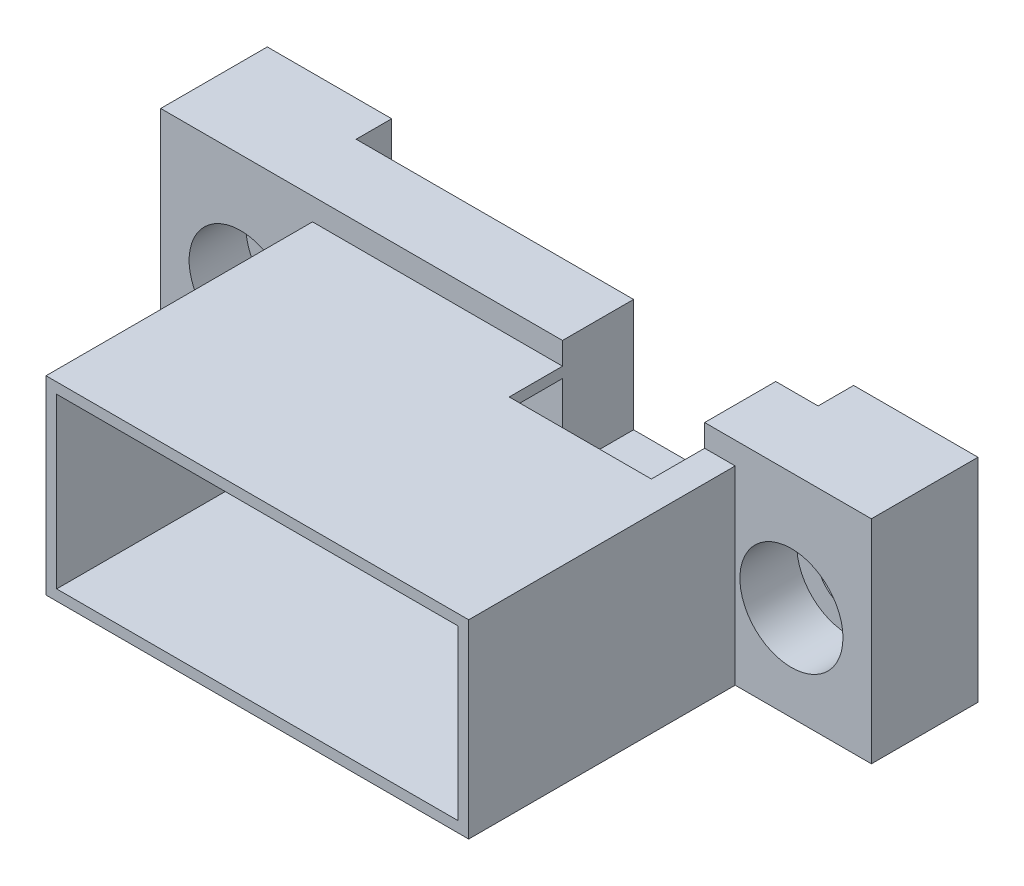
ISO-10303-21;
HEADER;
FILE_DESCRIPTION(('STEP AP214'),'2;1');
FILE_NAME('part.step','',(''),(''),'','','');
FILE_SCHEMA(('AUTOMOTIVE_DESIGN { 1 0 10303 214 1 1 1 1 }'));
ENDSEC;
DATA;
#1=APPLICATION_CONTEXT('core data for automotive mechanical design processes');
#2=APPLICATION_PROTOCOL_DEFINITION('international standard','automotive_design',2000,#1);
#3=PRODUCT_CONTEXT('',#1,'mechanical');
#4=PRODUCT('Part','Part','',(#3));
#5=PRODUCT_RELATED_PRODUCT_CATEGORY('part','',(#4));
#6=PRODUCT_DEFINITION_FORMATION('','',#4);
#7=PRODUCT_DEFINITION_CONTEXT('part definition',#1,'design');
#8=PRODUCT_DEFINITION('design','',#6,#7);
#9=PRODUCT_DEFINITION_SHAPE('','',#8);
#10=(LENGTH_UNIT() NAMED_UNIT(*) SI_UNIT(.MILLI.,.METRE.));
#11=(NAMED_UNIT(*) PLANE_ANGLE_UNIT() SI_UNIT($,.RADIAN.));
#12=(NAMED_UNIT(*) SI_UNIT($,.STERADIAN.) SOLID_ANGLE_UNIT());
#13=UNCERTAINTY_MEASURE_WITH_UNIT(LENGTH_MEASURE(1.E-05),#10,'distance_accuracy_value','');
#14=(GEOMETRIC_REPRESENTATION_CONTEXT(3) GLOBAL_UNCERTAINTY_ASSIGNED_CONTEXT((#13)) GLOBAL_UNIT_ASSIGNED_CONTEXT((#10,
#11,#12)) REPRESENTATION_CONTEXT('',''));
#15=CARTESIAN_POINT('',(0.,0.,0.));
#16=DIRECTION('',(0.,0.,1.));
#17=DIRECTION('',(1.,0.,0.));
#18=AXIS2_PLACEMENT_3D('',#15,#16,#17);
#19=CARTESIAN_POINT('',(0.,0.,7.62));
#20=DIRECTION('',(0.,0.,-1.));
#21=DIRECTION('',(-1.,0.,0.));
#22=AXIS2_PLACEMENT_3D('',#19,#20,#21);
#23=PLANE('',#22);
#24=CARTESIAN_POINT('',(-19.685,0.,7.62));
#25=DIRECTION('',(0.,0.,1.));
#26=DIRECTION('',(1.,0.,0.));
#27=AXIS2_PLACEMENT_3D('',#24,#25,#26);
#28=CIRCLE('',#27,3.683);
#29=CARTESIAN_POINT('',(-16.002,0.,7.62));
#30=VERTEX_POINT('',#29);
#31=EDGE_CURVE('E364',#30,#30,#28,.T.);
#32=ORIENTED_EDGE('',*,*,#31,.F.);
#33=EDGE_LOOP('',(#32));
#34=FACE_BOUND('',#33,.T.);
#35=DIRECTION('',(0.,-1.,0.));
#36=VECTOR('',#35,1.);
#37=CARTESIAN_POINT('',(-25.4,-8.382,7.62));
#38=LINE('',#37,#36);
#39=CARTESIAN_POINT('',(-25.4,8.382,7.62));
#40=VERTEX_POINT('',#39);
#41=CARTESIAN_POINT('',(-25.4,-6.78815,7.62));
#42=VERTEX_POINT('',#41);
#43=EDGE_CURVE('E229',#40,#42,#38,.T.);
#44=ORIENTED_EDGE('',*,*,#43,.T.);
#45=DIRECTION('',(1.,0.,0.));
#46=VECTOR('',#45,1.);
#47=CARTESIAN_POINT('',(0.,-6.78815,7.62));
#48=LINE('',#47,#46);
#49=CARTESIAN_POINT('',(-14.54785,-6.78815,7.62));
#50=VERTEX_POINT('',#49);
#51=EDGE_CURVE('E409',#42,#50,#48,.T.);
#52=ORIENTED_EDGE('',*,*,#51,.T.);
#53=DIRECTION('',(0.,-1.,0.));
#54=VECTOR('',#53,1.);
#55=CARTESIAN_POINT('',(-14.54785,6.78815,7.62));
#56=LINE('',#55,#54);
#57=CARTESIAN_POINT('',(-14.54785,6.78815,7.62));
#58=VERTEX_POINT('',#57);
#59=EDGE_CURVE('E302',#58,#50,#56,.T.);
#60=ORIENTED_EDGE('',*,*,#59,.F.);
#61=DIRECTION('',(-1.,0.,0.));
#62=VECTOR('',#61,1.);
#63=CARTESIAN_POINT('',(-14.54785,6.78815,7.62));
#64=LINE('',#63,#62);
#65=CARTESIAN_POINT('',(3.32105,6.78815,7.62));
#66=VERTEX_POINT('',#65);
#67=EDGE_CURVE('E287',#66,#58,#64,.T.);
#68=ORIENTED_EDGE('',*,*,#67,.F.);
#69=DIRECTION('',(0.,1.,0.));
#70=VECTOR('',#69,1.);
#71=CARTESIAN_POINT('',(3.32105,0.,7.62));
#72=LINE('',#71,#70);
#73=CARTESIAN_POINT('',(3.32105,8.382,7.62));
#74=VERTEX_POINT('',#73);
#75=EDGE_CURVE('E397',#66,#74,#72,.T.);
#76=ORIENTED_EDGE('',*,*,#75,.T.);
#77=DIRECTION('',(-1.,0.,0.));
#78=VECTOR('',#77,1.);
#79=CARTESIAN_POINT('',(-25.4,8.382,7.62));
#80=LINE('',#79,#78);
#81=EDGE_CURVE('E384',#74,#40,#80,.T.);
#82=ORIENTED_EDGE('',*,*,#81,.T.);
#83=EDGE_LOOP('',(#44,#52,#60,#68,#76,#82));
#84=FACE_BOUND('',#83,.T.);
#85=ADVANCED_FACE('F37',(#34,#84),#23,.F.);
#86=CARTESIAN_POINT('',(-25.4,8.382,7.62));
#87=DIRECTION('',(0.,-1.,0.));
#88=DIRECTION('',(0.,0.,-1.));
#89=AXIS2_PLACEMENT_3D('',#86,#87,#88);
#90=PLANE('',#89);
#91=DIRECTION('',(0.,0.,1.));
#92=VECTOR('',#91,1.);
#93=CARTESIAN_POINT('',(13.48105,8.382,2.54));
#94=LINE('',#93,#92);
#95=CARTESIAN_POINT('',(13.48105,8.382,2.54));
#96=VERTEX_POINT('',#95);
#97=CARTESIAN_POINT('',(13.48105,8.382,7.62));
#98=VERTEX_POINT('',#97);
#99=EDGE_CURVE('E320',#96,#98,#94,.T.);
#100=ORIENTED_EDGE('',*,*,#99,.T.);
#101=CARTESIAN_POINT('',(25.4,8.382,7.62));
#102=VERTEX_POINT('',#101);
#103=EDGE_CURVE('E385',#102,#98,#80,.T.);
#104=ORIENTED_EDGE('',*,*,#103,.F.);
#105=DIRECTION('',(0.,0.,-1.));
#106=VECTOR('',#105,1.);
#107=CARTESIAN_POINT('',(25.4,8.382,7.62));
#108=LINE('',#107,#106);
#109=CARTESIAN_POINT('',(25.4,8.382,0.));
#110=VERTEX_POINT('',#109);
#111=EDGE_CURVE('E238',#102,#110,#108,.T.);
#112=ORIENTED_EDGE('',*,*,#111,.T.);
#113=DIRECTION('',(-1.,0.,0.));
#114=VECTOR('',#113,1.);
#115=CARTESIAN_POINT('',(-25.4,8.382,0.));
#116=LINE('',#115,#114);
#117=CARTESIAN_POINT('',(16.51,8.382,0.));
#118=VERTEX_POINT('',#117);
#119=EDGE_CURVE('E219',#110,#118,#116,.T.);
#120=ORIENTED_EDGE('',*,*,#119,.T.);
#121=DIRECTION('',(0.,0.,1.));
#122=VECTOR('',#121,1.);
#123=CARTESIAN_POINT('',(16.51,8.382,7.62));
#124=LINE('',#123,#122);
#125=CARTESIAN_POINT('',(16.51,8.382,2.54));
#126=VERTEX_POINT('',#125);
#127=EDGE_CURVE('E342',#118,#126,#124,.T.);
#128=ORIENTED_EDGE('',*,*,#127,.T.);
#129=DIRECTION('',(-1.,0.,0.));
#130=VECTOR('',#129,1.);
#131=CARTESIAN_POINT('',(-25.4,8.382,2.54));
#132=LINE('',#131,#130);
#133=EDGE_CURVE('E334',#126,#96,#132,.T.);
#134=ORIENTED_EDGE('',*,*,#133,.T.);
#135=EDGE_LOOP('',(#100,#104,#112,#120,#128,#134));
#136=FACE_BOUND('',#135,.T.);
#137=ADVANCED_FACE('F499',(#136),#90,.F.);
#138=CARTESIAN_POINT('',(19.685,0.,7.62));
#139=DIRECTION('',(0.,0.,1.));
#140=DIRECTION('',(1.,0.,0.));
#141=AXIS2_PLACEMENT_3D('',#138,#139,#140);
#142=CIRCLE('',#141,3.683);
#143=CARTESIAN_POINT('',(23.368,0.,7.62));
#144=VERTEX_POINT('',#143);
#145=EDGE_CURVE('E367',#144,#144,#142,.T.);
#146=ORIENTED_EDGE('',*,*,#145,.F.);
#147=EDGE_LOOP('',(#146));
#148=FACE_BOUND('',#147,.T.);
#149=DIRECTION('',(0.,1.,0.));
#150=VECTOR('',#149,1.);
#151=CARTESIAN_POINT('',(15.66545,6.78815,7.62));
#152=LINE('',#151,#150);
#153=CARTESIAN_POINT('',(15.66545,-6.78815,7.62));
#154=VERTEX_POINT('',#153);
#155=CARTESIAN_POINT('',(15.66545,6.78815,7.62));
#156=VERTEX_POINT('',#155);
#157=EDGE_CURVE('E292',#154,#156,#152,.T.);
#158=ORIENTED_EDGE('',*,*,#157,.F.);
#159=CARTESIAN_POINT('',(25.4,-6.78815,7.62));
#160=VERTEX_POINT('',#159);
#161=EDGE_CURVE('E405',#154,#160,#48,.T.);
#162=ORIENTED_EDGE('',*,*,#161,.T.);
#163=DIRECTION('',(0.,1.,0.));
#164=VECTOR('',#163,1.);
#165=CARTESIAN_POINT('',(25.4,-8.382,7.62));
#166=LINE('',#165,#164);
#167=EDGE_CURVE('E213',#160,#102,#166,.T.);
#168=ORIENTED_EDGE('',*,*,#167,.T.);
#169=ORIENTED_EDGE('',*,*,#103,.T.);
#170=DIRECTION('',(0.,-1.,0.));
#171=VECTOR('',#170,1.);
#172=CARTESIAN_POINT('',(13.48105,0.,7.62));
#173=LINE('',#172,#171);
#174=CARTESIAN_POINT('',(13.48105,6.78815,7.62));
#175=VERTEX_POINT('',#174);
#176=EDGE_CURVE('E427',#98,#175,#173,.T.);
#177=ORIENTED_EDGE('',*,*,#176,.T.);
#178=EDGE_CURVE('E299',#156,#175,#64,.T.);
#179=ORIENTED_EDGE('',*,*,#178,.F.);
#180=EDGE_LOOP('',(#158,#162,#168,#169,#177,#179));
#181=FACE_BOUND('',#180,.T.);
#182=ADVANCED_FACE('F502',(#148,#181),#23,.F.);
#183=CARTESIAN_POINT('',(0.,0.,0.));
#184=DIRECTION('',(0.,0.,-1.));
#185=DIRECTION('',(-1.,0.,0.));
#186=AXIS2_PLACEMENT_3D('',#183,#184,#185);
#187=PLANE('',#186);
#188=DIRECTION('',(-1.,0.,0.));
#189=VECTOR('',#188,1.);
#190=CARTESIAN_POINT('',(-25.4,-6.78815,0.));
#191=LINE('',#190,#189);
#192=CARTESIAN_POINT('',(25.4,-6.78815,0.));
#193=VERTEX_POINT('',#192);
#194=CARTESIAN_POINT('',(16.51,-6.78815,0.));
#195=VERTEX_POINT('',#194);
#196=EDGE_CURVE('E195',#193,#195,#191,.T.);
#197=ORIENTED_EDGE('',*,*,#196,.T.);
#198=DIRECTION('',(0.,-1.,0.));
#199=VECTOR('',#198,1.);
#200=CARTESIAN_POINT('',(16.51,0.,0.));
#201=LINE('',#200,#199);
#202=EDGE_CURVE('E345',#118,#195,#201,.T.);
#203=ORIENTED_EDGE('',*,*,#202,.F.);
#204=ORIENTED_EDGE('',*,*,#119,.F.);
#205=DIRECTION('',(0.,1.,0.));
#206=VECTOR('',#205,1.);
#207=CARTESIAN_POINT('',(25.4,-8.382,0.));
#208=LINE('',#207,#206);
#209=EDGE_CURVE('E211',#193,#110,#208,.T.);
#210=ORIENTED_EDGE('',*,*,#209,.F.);
#211=EDGE_LOOP('',(#197,#203,#204,#210));
#212=FACE_BOUND('',#211,.T.);
#213=CARTESIAN_POINT('',(19.685,0.,0.));
#214=DIRECTION('',(0.,0.,1.));
#215=DIRECTION('',(1.,0.,0.));
#216=AXIS2_PLACEMENT_3D('',#213,#214,#215);
#217=CIRCLE('',#216,2.2225);
#218=CARTESIAN_POINT('',(21.9075,0.,0.));
#219=VERTEX_POINT('',#218);
#220=EDGE_CURVE('E347',#219,#219,#217,.T.);
#221=ORIENTED_EDGE('',*,*,#220,.T.);
#222=EDGE_LOOP('',(#221));
#223=FACE_BOUND('',#222,.T.);
#224=ADVANCED_FACE('F216',(#212,#223),#187,.T.);
#225=CARTESIAN_POINT('',(12.36345,-3.48615,7.62));
#226=DIRECTION('',(0.,0.,1.));
#227=DIRECTION('',(1.,0.,0.));
#228=AXIS2_PLACEMENT_3D('',#225,#226,#227);
#229=CIRCLE('',#228,0.825500000000003);
#230=CARTESIAN_POINT('',(13.18895,-3.48615,7.62));
#231=VERTEX_POINT('',#230);
#232=EDGE_CURVE('E222',#231,#231,#229,.T.);
#233=ORIENTED_EDGE('',*,*,#232,.F.);
#234=EDGE_LOOP('',(#233));
#235=FACE_BOUND('',#234,.T.);
#236=CARTESIAN_POINT('',(-11.24585,3.48615,7.62));
#237=DIRECTION('',(0.,0.,1.));
#238=DIRECTION('',(1.,0.,0.));
#239=AXIS2_PLACEMENT_3D('',#236,#237,#238);
#240=CIRCLE('',#239,0.825500000000009);
#241=CARTESIAN_POINT('',(-10.42035,3.48615,7.62));
#242=VERTEX_POINT('',#241);
#243=EDGE_CURVE('E363',#242,#242,#240,.T.);
#244=ORIENTED_EDGE('',*,*,#243,.F.);
#245=EDGE_LOOP('',(#244));
#246=FACE_BOUND('',#245,.T.);
#247=DIRECTION('',(-1.,0.,0.));
#248=VECTOR('',#247,1.);
#249=CARTESIAN_POINT('',(-13.78585,6.02615,7.62));
#250=LINE('',#249,#248);
#251=CARTESIAN_POINT('',(14.90345,6.02615,7.62));
#252=VERTEX_POINT('',#251);
#253=CARTESIAN_POINT('',(13.48105,6.02615,7.62));
#254=VERTEX_POINT('',#253);
#255=EDGE_CURVE('E268',#252,#254,#250,.T.);
#256=ORIENTED_EDGE('',*,*,#255,.T.);
#257=DIRECTION('',(0.,-1.,0.));
#258=VECTOR('',#257,1.);
#259=CARTESIAN_POINT('',(13.48105,0.,7.62));
#260=LINE('',#259,#258);
#261=CARTESIAN_POINT('',(13.48105,0.31115,7.62));
#262=VERTEX_POINT('',#261);
#263=EDGE_CURVE('E374',#254,#262,#260,.T.);
#264=ORIENTED_EDGE('',*,*,#263,.T.);
#265=DIRECTION('',(-1.,0.,0.));
#266=VECTOR('',#265,1.);
#267=CARTESIAN_POINT('',(0.,0.311149999999998,7.62));
#268=LINE('',#267,#266);
#269=CARTESIAN_POINT('',(3.32105,0.311149999999998,7.62));
#270=VERTEX_POINT('',#269);
#271=EDGE_CURVE('E379',#262,#270,#268,.T.);
#272=ORIENTED_EDGE('',*,*,#271,.T.);
#273=DIRECTION('',(0.,-1.,0.));
#274=VECTOR('',#273,1.);
#275=CARTESIAN_POINT('',(3.32105,0.,7.62));
#276=LINE('',#275,#274);
#277=CARTESIAN_POINT('',(3.32105,6.02615,7.62));
#278=VERTEX_POINT('',#277);
#279=EDGE_CURVE('E226',#278,#270,#276,.T.);
#280=ORIENTED_EDGE('',*,*,#279,.F.);
#281=CARTESIAN_POINT('',(-13.78585,6.02615,7.62));
#282=VERTEX_POINT('',#281);
#283=EDGE_CURVE('E260',#278,#282,#250,.T.);
#284=ORIENTED_EDGE('',*,*,#283,.T.);
#285=DIRECTION('',(0.,-1.,0.));
#286=VECTOR('',#285,1.);
#287=CARTESIAN_POINT('',(-13.78585,6.02615,7.62));
#288=LINE('',#287,#286);
#289=CARTESIAN_POINT('',(-13.78585,-6.02615,7.62));
#290=VERTEX_POINT('',#289);
#291=EDGE_CURVE('E429',#282,#290,#288,.T.);
#292=ORIENTED_EDGE('',*,*,#291,.T.);
#293=DIRECTION('',(1.,0.,0.));
#294=VECTOR('',#293,1.);
#295=CARTESIAN_POINT('',(-13.78585,-6.02615,7.62));
#296=LINE('',#295,#294);
#297=CARTESIAN_POINT('',(14.90345,-6.02615,7.62));
#298=VERTEX_POINT('',#297);
#299=EDGE_CURVE('E274',#290,#298,#296,.T.);
#300=ORIENTED_EDGE('',*,*,#299,.T.);
#301=DIRECTION('',(0.,1.,0.));
#302=VECTOR('',#301,1.);
#303=CARTESIAN_POINT('',(14.90345,6.02615,7.62));
#304=LINE('',#303,#302);
#305=EDGE_CURVE('E269',#298,#252,#304,.T.);
#306=ORIENTED_EDGE('',*,*,#305,.T.);
#307=EDGE_LOOP('',(#256,#264,#272,#280,#284,#292,#300,#306));
#308=FACE_BOUND('',#307,.T.);
#309=ADVANCED_FACE('F438',(#235,#246,#308),#23,.F.);
#310=CARTESIAN_POINT('',(-16.51,-6.78815,0.));
#311=VERTEX_POINT('',#310);
#312=CARTESIAN_POINT('',(-25.4,-6.78815,0.));
#313=VERTEX_POINT('',#312);
#314=EDGE_CURVE('E52',#311,#313,#191,.T.);
#315=ORIENTED_EDGE('',*,*,#314,.T.);
#316=DIRECTION('',(0.,-1.,0.));
#317=VECTOR('',#316,1.);
#318=CARTESIAN_POINT('',(-25.4,-8.382,0.));
#319=LINE('',#318,#317);
#320=CARTESIAN_POINT('',(-25.4,8.382,0.));
#321=VERTEX_POINT('',#320);
#322=EDGE_CURVE('E232',#321,#313,#319,.T.);
#323=ORIENTED_EDGE('',*,*,#322,.F.);
#324=CARTESIAN_POINT('',(-16.51,8.382,0.));
#325=VERTEX_POINT('',#324);
#326=EDGE_CURVE('E221',#325,#321,#116,.T.);
#327=ORIENTED_EDGE('',*,*,#326,.F.);
#328=DIRECTION('',(0.,1.,0.));
#329=VECTOR('',#328,1.);
#330=CARTESIAN_POINT('',(-16.51,0.,0.));
#331=LINE('',#330,#329);
#332=EDGE_CURVE('E340',#311,#325,#331,.T.);
#333=ORIENTED_EDGE('',*,*,#332,.F.);
#334=EDGE_LOOP('',(#315,#323,#327,#333));
#335=FACE_BOUND('',#334,.T.);
#336=CARTESIAN_POINT('',(-19.685,0.,0.));
#337=DIRECTION('',(0.,0.,1.));
#338=DIRECTION('',(1.,0.,0.));
#339=AXIS2_PLACEMENT_3D('',#336,#337,#338);
#340=CIRCLE('',#339,2.2225);
#341=CARTESIAN_POINT('',(-17.4625,0.,0.));
#342=VERTEX_POINT('',#341);
#343=EDGE_CURVE('E348',#342,#342,#340,.T.);
#344=ORIENTED_EDGE('',*,*,#343,.T.);
#345=EDGE_LOOP('',(#344));
#346=FACE_BOUND('',#345,.T.);
#347=ADVANCED_FACE('F476',(#335,#346),#187,.T.);
#348=CARTESIAN_POINT('',(25.4,-8.382,7.62));
#349=DIRECTION('',(-1.,0.,0.));
#350=DIRECTION('',(0.,0.,1.));
#351=AXIS2_PLACEMENT_3D('',#348,#349,#350);
#352=PLANE('',#351);
#353=ORIENTED_EDGE('',*,*,#167,.F.);
#354=DIRECTION('',(0.,0.,1.));
#355=VECTOR('',#354,1.);
#356=CARTESIAN_POINT('',(25.4,-6.78815,0.));
#357=LINE('',#356,#355);
#358=EDGE_CURVE('E199',#193,#160,#357,.T.);
#359=ORIENTED_EDGE('',*,*,#358,.F.);
#360=ORIENTED_EDGE('',*,*,#209,.T.);
#361=ORIENTED_EDGE('',*,*,#111,.F.);
#362=EDGE_LOOP('',(#353,#359,#360,#361));
#363=FACE_BOUND('',#362,.T.);
#364=ADVANCED_FACE('F39',(#363),#352,.F.);
#365=ORIENTED_EDGE('',*,*,#81,.F.);
#366=DIRECTION('',(0.,0.,-1.));
#367=VECTOR('',#366,1.);
#368=CARTESIAN_POINT('',(3.32105,8.382,2.54));
#369=LINE('',#368,#367);
#370=CARTESIAN_POINT('',(3.32105,8.382,2.54));
#371=VERTEX_POINT('',#370);
#372=EDGE_CURVE('E317',#74,#371,#369,.T.);
#373=ORIENTED_EDGE('',*,*,#372,.T.);
#374=CARTESIAN_POINT('',(-16.51,8.382,2.54));
#375=VERTEX_POINT('',#374);
#376=EDGE_CURVE('E333',#371,#375,#132,.T.);
#377=ORIENTED_EDGE('',*,*,#376,.T.);
#378=DIRECTION('',(0.,0.,-1.));
#379=VECTOR('',#378,1.);
#380=CARTESIAN_POINT('',(-16.51,8.382,7.62));
#381=LINE('',#380,#379);
#382=EDGE_CURVE('E337',#375,#325,#381,.T.);
#383=ORIENTED_EDGE('',*,*,#382,.T.);
#384=ORIENTED_EDGE('',*,*,#326,.T.);
#385=DIRECTION('',(0.,0.,-1.));
#386=VECTOR('',#385,1.);
#387=CARTESIAN_POINT('',(-25.4,8.382,7.62));
#388=LINE('',#387,#386);
#389=EDGE_CURVE('E235',#40,#321,#388,.T.);
#390=ORIENTED_EDGE('',*,*,#389,.F.);
#391=EDGE_LOOP('',(#365,#373,#377,#383,#384,#390));
#392=FACE_BOUND('',#391,.T.);
#393=ADVANCED_FACE('F399',(#392),#90,.F.);
#394=CARTESIAN_POINT('',(-25.4,-8.382,7.62));
#395=DIRECTION('',(1.,0.,0.));
#396=DIRECTION('',(0.,0.,-1.));
#397=AXIS2_PLACEMENT_3D('',#394,#395,#396);
#398=PLANE('',#397);
#399=ORIENTED_EDGE('',*,*,#322,.T.);
#400=DIRECTION('',(0.,0.,1.));
#401=VECTOR('',#400,1.);
#402=CARTESIAN_POINT('',(-25.4,-6.78815,0.));
#403=LINE('',#402,#401);
#404=EDGE_CURVE('E214',#313,#42,#403,.T.);
#405=ORIENTED_EDGE('',*,*,#404,.T.);
#406=ORIENTED_EDGE('',*,*,#43,.F.);
#407=ORIENTED_EDGE('',*,*,#389,.T.);
#408=EDGE_LOOP('',(#399,#405,#406,#407));
#409=FACE_BOUND('',#408,.T.);
#410=ADVANCED_FACE('F404',(#409),#398,.F.);
#411=CARTESIAN_POINT('',(-11.24585,3.48615,0.));
#412=DIRECTION('',(0.,0.,1.));
#413=DIRECTION('',(1.,0.,0.));
#414=AXIS2_PLACEMENT_3D('',#411,#412,#413);
#415=CYLINDRICAL_SURFACE('',#414,0.825500000000009);
#416=CARTESIAN_POINT('',(-11.24585,3.48615,2.54));
#417=DIRECTION('',(0.,0.,1.));
#418=DIRECTION('',(1.,0.,0.));
#419=AXIS2_PLACEMENT_3D('',#416,#417,#418);
#420=CIRCLE('',#419,0.825500000000009);
#421=CARTESIAN_POINT('',(-10.42035,3.48615,2.54));
#422=VERTEX_POINT('',#421);
#423=EDGE_CURVE('E330',#422,#422,#420,.F.);
#424=ORIENTED_EDGE('',*,*,#423,.T.);
#425=EDGE_LOOP('',(#424));
#426=FACE_BOUND('',#425,.T.);
#427=ORIENTED_EDGE('',*,*,#243,.T.);
#428=EDGE_LOOP('',(#427));
#429=FACE_BOUND('',#428,.T.);
#430=ADVANCED_FACE('F523',(#426,#429),#415,.F.);
#431=CARTESIAN_POINT('',(13.48105,0.,0.));
#432=DIRECTION('',(-1.,0.,0.));
#433=DIRECTION('',(0.,-1.,0.));
#434=AXIS2_PLACEMENT_3D('',#431,#432,#433);
#435=PLANE('',#434);
#436=ORIENTED_EDGE('',*,*,#263,.F.);
#437=DIRECTION('',(0.,0.,1.));
#438=VECTOR('',#437,1.);
#439=CARTESIAN_POINT('',(13.48105,6.02615,26.67));
#440=LINE('',#439,#438);
#441=CARTESIAN_POINT('',(13.48105,6.02615,11.43));
#442=VERTEX_POINT('',#441);
#443=EDGE_CURVE('E11',#254,#442,#440,.T.);
#444=ORIENTED_EDGE('',*,*,#443,.T.);
#445=DIRECTION('',(0.,-1.,0.));
#446=VECTOR('',#445,1.);
#447=CARTESIAN_POINT('',(13.48105,8.382,11.43));
#448=LINE('',#447,#446);
#449=CARTESIAN_POINT('',(13.48105,6.78815,11.43));
#450=VERTEX_POINT('',#449);
#451=EDGE_CURVE('E60',#450,#442,#448,.T.);
#452=ORIENTED_EDGE('',*,*,#451,.F.);
#453=DIRECTION('',(0.,0.,1.));
#454=VECTOR('',#453,1.);
#455=CARTESIAN_POINT('',(13.48105,6.78815,26.67));
#456=LINE('',#455,#454);
#457=EDGE_CURVE('E424',#175,#450,#456,.T.);
#458=ORIENTED_EDGE('',*,*,#457,.F.);
#459=ORIENTED_EDGE('',*,*,#176,.F.);
#460=ORIENTED_EDGE('',*,*,#99,.F.);
#461=DIRECTION('',(0.,1.,0.));
#462=VECTOR('',#461,1.);
#463=CARTESIAN_POINT('',(13.48105,0.,2.54));
#464=LINE('',#463,#462);
#465=CARTESIAN_POINT('',(13.48105,0.31115,2.54));
#466=VERTEX_POINT('',#465);
#467=EDGE_CURVE('E328',#466,#96,#464,.T.);
#468=ORIENTED_EDGE('',*,*,#467,.F.);
#469=DIRECTION('',(0.,0.,1.));
#470=VECTOR('',#469,1.);
#471=CARTESIAN_POINT('',(13.48105,0.31115,0.));
#472=LINE('',#471,#470);
#473=EDGE_CURVE('E375',#466,#262,#472,.T.);
#474=ORIENTED_EDGE('',*,*,#473,.T.);
#475=EDGE_LOOP('',(#436,#444,#452,#458,#459,#460,#468,#474));
#476=FACE_BOUND('',#475,.T.);
#477=ADVANCED_FACE('F457',(#476),#435,.T.);
#478=CARTESIAN_POINT('',(0.,0.311149999999998,0.));
#479=DIRECTION('',(0.,1.,0.));
#480=DIRECTION('',(-1.,0.,0.));
#481=AXIS2_PLACEMENT_3D('',#478,#479,#480);
#482=PLANE('',#481);
#483=DIRECTION('',(1.,0.,0.));
#484=VECTOR('',#483,1.);
#485=CARTESIAN_POINT('',(0.,0.311149999999998,2.54));
#486=LINE('',#485,#484);
#487=CARTESIAN_POINT('',(3.32105,0.311149999999998,2.54));
#488=VERTEX_POINT('',#487);
#489=EDGE_CURVE('E326',#488,#466,#486,.T.);
#490=ORIENTED_EDGE('',*,*,#489,.F.);
#491=DIRECTION('',(0.,0.,1.));
#492=VECTOR('',#491,1.);
#493=CARTESIAN_POINT('',(3.32105,0.311149999999998,0.));
#494=LINE('',#493,#492);
#495=EDGE_CURVE('E372',#488,#270,#494,.T.);
#496=ORIENTED_EDGE('',*,*,#495,.T.);
#497=ORIENTED_EDGE('',*,*,#271,.F.);
#498=ORIENTED_EDGE('',*,*,#473,.F.);
#499=EDGE_LOOP('',(#490,#496,#497,#498));
#500=FACE_BOUND('',#499,.T.);
#501=ADVANCED_FACE('F463',(#500),#482,.T.);
#502=CARTESIAN_POINT('',(3.32105,0.,0.));
#503=DIRECTION('',(-1.,0.,0.));
#504=DIRECTION('',(0.,-1.,0.));
#505=AXIS2_PLACEMENT_3D('',#502,#503,#504);
#506=PLANE('',#505);
#507=DIRECTION('',(0.,0.,-1.));
#508=VECTOR('',#507,1.);
#509=CARTESIAN_POINT('',(3.32105,6.02615,26.67));
#510=LINE('',#509,#508);
#511=CARTESIAN_POINT('',(3.32105,6.02615,11.43));
#512=VERTEX_POINT('',#511);
#513=EDGE_CURVE('E45',#512,#278,#510,.T.);
#514=ORIENTED_EDGE('',*,*,#513,.T.);
#515=ORIENTED_EDGE('',*,*,#279,.T.);
#516=ORIENTED_EDGE('',*,*,#495,.F.);
#517=DIRECTION('',(0.,1.,0.));
#518=VECTOR('',#517,1.);
#519=CARTESIAN_POINT('',(3.32105,0.,2.54));
#520=LINE('',#519,#518);
#521=EDGE_CURVE('E244',#488,#371,#520,.T.);
#522=ORIENTED_EDGE('',*,*,#521,.T.);
#523=ORIENTED_EDGE('',*,*,#372,.F.);
#524=ORIENTED_EDGE('',*,*,#75,.F.);
#525=DIRECTION('',(0.,0.,-1.));
#526=VECTOR('',#525,1.);
#527=CARTESIAN_POINT('',(3.32105,6.78815,26.67));
#528=LINE('',#527,#526);
#529=CARTESIAN_POINT('',(3.32105,6.78815,11.43));
#530=VERTEX_POINT('',#529);
#531=EDGE_CURVE('E420',#530,#66,#528,.T.);
#532=ORIENTED_EDGE('',*,*,#531,.F.);
#533=DIRECTION('',(0.,1.,0.));
#534=VECTOR('',#533,1.);
#535=CARTESIAN_POINT('',(3.32105,5.39115,11.43));
#536=LINE('',#535,#534);
#537=EDGE_CURVE('E257',#512,#530,#536,.T.);
#538=ORIENTED_EDGE('',*,*,#537,.F.);
#539=EDGE_LOOP('',(#514,#515,#516,#522,#523,#524,#532,#538));
#540=FACE_BOUND('',#539,.T.);
#541=ADVANCED_FACE('F253',(#540),#506,.F.);
#542=CARTESIAN_POINT('',(12.36345,-3.48615,0.));
#543=DIRECTION('',(0.,0.,1.));
#544=DIRECTION('',(1.,0.,0.));
#545=AXIS2_PLACEMENT_3D('',#542,#543,#544);
#546=CYLINDRICAL_SURFACE('',#545,0.825500000000003);
#547=CARTESIAN_POINT('',(12.36345,-3.48615,2.54));
#548=DIRECTION('',(0.,0.,1.));
#549=DIRECTION('',(1.,0.,0.));
#550=AXIS2_PLACEMENT_3D('',#547,#548,#549);
#551=CIRCLE('',#550,0.825500000000003);
#552=CARTESIAN_POINT('',(13.18895,-3.48615,2.54));
#553=VERTEX_POINT('',#552);
#554=EDGE_CURVE('E241',#553,#553,#551,.F.);
#555=ORIENTED_EDGE('',*,*,#554,.T.);
#556=EDGE_LOOP('',(#555));
#557=FACE_BOUND('',#556,.T.);
#558=ORIENTED_EDGE('',*,*,#232,.T.);
#559=EDGE_LOOP('',(#558));
#560=FACE_BOUND('',#559,.T.);
#561=ADVANCED_FACE('F538',(#557,#560),#546,.F.);
#562=CARTESIAN_POINT('',(19.685,0.,3.556));
#563=DIRECTION('',(0.,0.,1.));
#564=DIRECTION('',(1.,0.,0.));
#565=AXIS2_PLACEMENT_3D('',#562,#563,#564);
#566=CYLINDRICAL_SURFACE('',#565,3.683);
#567=CARTESIAN_POINT('',(19.685,0.,3.556));
#568=DIRECTION('',(0.,0.,1.));
#569=DIRECTION('',(1.,0.,0.));
#570=AXIS2_PLACEMENT_3D('',#567,#568,#569);
#571=CIRCLE('',#570,3.683);
#572=CARTESIAN_POINT('',(23.368,0.,3.556));
#573=VERTEX_POINT('',#572);
#574=EDGE_CURVE('E359',#573,#573,#571,.T.);
#575=ORIENTED_EDGE('',*,*,#574,.F.);
#576=EDGE_LOOP('',(#575));
#577=FACE_BOUND('',#576,.T.);
#578=ORIENTED_EDGE('',*,*,#145,.T.);
#579=EDGE_LOOP('',(#578));
#580=FACE_BOUND('',#579,.T.);
#581=ADVANCED_FACE('F541',(#577,#580),#566,.F.);
#582=CARTESIAN_POINT('',(19.685,0.,3.556));
#583=DIRECTION('',(0.,0.,1.));
#584=DIRECTION('',(1.,0.,0.));
#585=AXIS2_PLACEMENT_3D('',#582,#583,#584);
#586=PLANE('',#585);
#587=CARTESIAN_POINT('',(19.685,0.,3.556));
#588=DIRECTION('',(0.,0.,1.));
#589=DIRECTION('',(1.,0.,0.));
#590=AXIS2_PLACEMENT_3D('',#587,#588,#589);
#591=CIRCLE('',#590,2.2225);
#592=CARTESIAN_POINT('',(21.9075,0.,3.556));
#593=VERTEX_POINT('',#592);
#594=EDGE_CURVE('E356',#593,#593,#591,.T.);
#595=ORIENTED_EDGE('',*,*,#594,.F.);
#596=EDGE_LOOP('',(#595));
#597=FACE_BOUND('',#596,.T.);
#598=ORIENTED_EDGE('',*,*,#574,.T.);
#599=EDGE_LOOP('',(#598));
#600=FACE_BOUND('',#599,.T.);
#601=ADVANCED_FACE('F543',(#597,#600),#586,.T.);
#602=CARTESIAN_POINT('',(-19.685,0.,3.556));
#603=DIRECTION('',(0.,0.,1.));
#604=DIRECTION('',(1.,0.,0.));
#605=AXIS2_PLACEMENT_3D('',#602,#603,#604);
#606=CYLINDRICAL_SURFACE('',#605,3.683);
#607=CARTESIAN_POINT('',(-19.685,0.,3.556));
#608=DIRECTION('',(0.,0.,1.));
#609=DIRECTION('',(1.,0.,0.));
#610=AXIS2_PLACEMENT_3D('',#607,#608,#609);
#611=CIRCLE('',#610,3.683);
#612=CARTESIAN_POINT('',(-16.002,0.,3.556));
#613=VERTEX_POINT('',#612);
#614=EDGE_CURVE('E360',#613,#613,#611,.T.);
#615=ORIENTED_EDGE('',*,*,#614,.F.);
#616=EDGE_LOOP('',(#615));
#617=FACE_BOUND('',#616,.T.);
#618=ORIENTED_EDGE('',*,*,#31,.T.);
#619=EDGE_LOOP('',(#618));
#620=FACE_BOUND('',#619,.T.);
#621=ADVANCED_FACE('F494',(#617,#620),#606,.F.);
#622=CARTESIAN_POINT('',(-19.685,0.,3.556));
#623=DIRECTION('',(0.,0.,1.));
#624=DIRECTION('',(1.,0.,0.));
#625=AXIS2_PLACEMENT_3D('',#622,#623,#624);
#626=PLANE('',#625);
#627=CARTESIAN_POINT('',(-19.685,0.,3.556));
#628=DIRECTION('',(0.,0.,1.));
#629=DIRECTION('',(1.,0.,0.));
#630=AXIS2_PLACEMENT_3D('',#627,#628,#629);
#631=CIRCLE('',#630,2.2225);
#632=CARTESIAN_POINT('',(-17.4625,0.,3.556));
#633=VERTEX_POINT('',#632);
#634=EDGE_CURVE('E351',#633,#633,#631,.T.);
#635=ORIENTED_EDGE('',*,*,#634,.F.);
#636=EDGE_LOOP('',(#635));
#637=FACE_BOUND('',#636,.T.);
#638=ORIENTED_EDGE('',*,*,#614,.T.);
#639=EDGE_LOOP('',(#638));
#640=FACE_BOUND('',#639,.T.);
#641=ADVANCED_FACE('F485',(#637,#640),#626,.T.);
#642=CARTESIAN_POINT('',(-19.685,0.,0.));
#643=DIRECTION('',(0.,0.,1.));
#644=DIRECTION('',(1.,0.,0.));
#645=AXIS2_PLACEMENT_3D('',#642,#643,#644);
#646=CYLINDRICAL_SURFACE('',#645,2.2225);
#647=ORIENTED_EDGE('',*,*,#634,.T.);
#648=EDGE_LOOP('',(#647));
#649=FACE_BOUND('',#648,.T.);
#650=ORIENTED_EDGE('',*,*,#343,.F.);
#651=EDGE_LOOP('',(#650));
#652=FACE_BOUND('',#651,.T.);
#653=ADVANCED_FACE('F482',(#649,#652),#646,.F.);
#654=CARTESIAN_POINT('',(19.685,0.,0.));
#655=DIRECTION('',(0.,0.,1.));
#656=DIRECTION('',(1.,0.,0.));
#657=AXIS2_PLACEMENT_3D('',#654,#655,#656);
#658=CYLINDRICAL_SURFACE('',#657,2.2225);
#659=ORIENTED_EDGE('',*,*,#594,.T.);
#660=EDGE_LOOP('',(#659));
#661=FACE_BOUND('',#660,.T.);
#662=ORIENTED_EDGE('',*,*,#220,.F.);
#663=EDGE_LOOP('',(#662));
#664=FACE_BOUND('',#663,.T.);
#665=ADVANCED_FACE('F484',(#661,#664),#658,.F.);
#666=CARTESIAN_POINT('',(-16.51,-8.382,2.54));
#667=DIRECTION('',(0.,0.,1.));
#668=DIRECTION('',(1.,0.,0.));
#669=AXIS2_PLACEMENT_3D('',#666,#667,#668);
#670=PLANE('',#669);
#671=ORIENTED_EDGE('',*,*,#554,.F.);
#672=EDGE_LOOP('',(#671));
#673=FACE_BOUND('',#672,.T.);
#674=DIRECTION('',(0.,1.,0.));
#675=VECTOR('',#674,1.);
#676=CARTESIAN_POINT('',(16.51,-8.382,2.54));
#677=LINE('',#676,#675);
#678=CARTESIAN_POINT('',(16.51,-6.78815,2.54));
#679=VERTEX_POINT('',#678);
#680=EDGE_CURVE('E245',#679,#126,#677,.T.);
#681=ORIENTED_EDGE('',*,*,#680,.F.);
#682=DIRECTION('',(-1.,0.,0.));
#683=VECTOR('',#682,1.);
#684=CARTESIAN_POINT('',(-16.51,-6.78815,2.54));
#685=LINE('',#684,#683);
#686=CARTESIAN_POINT('',(-16.51,-6.78815,2.54));
#687=VERTEX_POINT('',#686);
#688=EDGE_CURVE('E412',#679,#687,#685,.T.);
#689=ORIENTED_EDGE('',*,*,#688,.T.);
#690=DIRECTION('',(0.,1.,0.));
#691=VECTOR('',#690,1.);
#692=CARTESIAN_POINT('',(-16.51,-8.382,2.54));
#693=LINE('',#692,#691);
#694=EDGE_CURVE('E322',#687,#375,#693,.T.);
#695=ORIENTED_EDGE('',*,*,#694,.T.);
#696=ORIENTED_EDGE('',*,*,#376,.F.);
#697=ORIENTED_EDGE('',*,*,#521,.F.);
#698=ORIENTED_EDGE('',*,*,#489,.T.);
#699=ORIENTED_EDGE('',*,*,#467,.T.);
#700=ORIENTED_EDGE('',*,*,#133,.F.);
#701=EDGE_LOOP('',(#681,#689,#695,#696,#697,#698,#699,#700));
#702=FACE_BOUND('',#701,.T.);
#703=ORIENTED_EDGE('',*,*,#423,.F.);
#704=EDGE_LOOP('',(#703));
#705=FACE_BOUND('',#704,.T.);
#706=ADVANCED_FACE('F469',(#673,#702,#705),#670,.F.);
#707=CARTESIAN_POINT('',(16.51,-8.382,-2.54));
#708=DIRECTION('',(1.,0.,0.));
#709=DIRECTION('',(0.,0.,-1.));
#710=AXIS2_PLACEMENT_3D('',#707,#708,#709);
#711=PLANE('',#710);
#712=ORIENTED_EDGE('',*,*,#202,.T.);
#713=DIRECTION('',(0.,0.,1.));
#714=VECTOR('',#713,1.);
#715=CARTESIAN_POINT('',(16.51,-6.78815,-2.54));
#716=LINE('',#715,#714);
#717=EDGE_CURVE('E202',#195,#679,#716,.T.);
#718=ORIENTED_EDGE('',*,*,#717,.T.);
#719=ORIENTED_EDGE('',*,*,#680,.T.);
#720=ORIENTED_EDGE('',*,*,#127,.F.);
#721=EDGE_LOOP('',(#712,#718,#719,#720));
#722=FACE_BOUND('',#721,.T.);
#723=ADVANCED_FACE('F767',(#722),#711,.F.);
#724=CARTESIAN_POINT('',(-16.51,-8.382,-2.54));
#725=DIRECTION('',(-1.,0.,0.));
#726=DIRECTION('',(0.,0.,1.));
#727=AXIS2_PLACEMENT_3D('',#724,#725,#726);
#728=PLANE('',#727);
#729=ORIENTED_EDGE('',*,*,#694,.F.);
#730=DIRECTION('',(0.,0.,-1.));
#731=VECTOR('',#730,1.);
#732=CARTESIAN_POINT('',(-16.51,-6.78815,-2.54));
#733=LINE('',#732,#731);
#734=EDGE_CURVE('E407',#687,#311,#733,.T.);
#735=ORIENTED_EDGE('',*,*,#734,.T.);
#736=ORIENTED_EDGE('',*,*,#332,.T.);
#737=ORIENTED_EDGE('',*,*,#382,.F.);
#738=EDGE_LOOP('',(#729,#735,#736,#737));
#739=FACE_BOUND('',#738,.T.);
#740=ADVANCED_FACE('F473',(#739),#728,.F.);
#741=CARTESIAN_POINT('',(0.,0.,26.67));
#742=DIRECTION('',(0.,0.,-1.));
#743=DIRECTION('',(-1.,0.,0.));
#744=AXIS2_PLACEMENT_3D('',#741,#742,#743);
#745=PLANE('',#744);
#746=DIRECTION('',(-1.,0.,0.));
#747=VECTOR('',#746,1.);
#748=CARTESIAN_POINT('',(-14.54785,6.78815,26.67));
#749=LINE('',#748,#747);
#750=CARTESIAN_POINT('',(15.66545,6.78815,26.67));
#751=VERTEX_POINT('',#750);
#752=CARTESIAN_POINT('',(-14.54785,6.78815,26.67));
#753=VERTEX_POINT('',#752);
#754=EDGE_CURVE('E288',#751,#753,#749,.T.);
#755=ORIENTED_EDGE('',*,*,#754,.T.);
#756=DIRECTION('',(0.,-1.,0.));
#757=VECTOR('',#756,1.);
#758=CARTESIAN_POINT('',(-14.54785,6.78815,26.67));
#759=LINE('',#758,#757);
#760=CARTESIAN_POINT('',(-14.54785,-6.78815,26.67));
#761=VERTEX_POINT('',#760);
#762=EDGE_CURVE('E291',#753,#761,#759,.T.);
#763=ORIENTED_EDGE('',*,*,#762,.T.);
#764=DIRECTION('',(1.,0.,0.));
#765=VECTOR('',#764,1.);
#766=CARTESIAN_POINT('',(-14.54785,-6.78815,26.67));
#767=LINE('',#766,#765);
#768=CARTESIAN_POINT('',(15.66545,-6.78815,26.67));
#769=VERTEX_POINT('',#768);
#770=EDGE_CURVE('E294',#761,#769,#767,.T.);
#771=ORIENTED_EDGE('',*,*,#770,.T.);
#772=DIRECTION('',(0.,1.,0.));
#773=VECTOR('',#772,1.);
#774=CARTESIAN_POINT('',(15.66545,6.78815,26.67));
#775=LINE('',#774,#773);
#776=EDGE_CURVE('E296',#769,#751,#775,.T.);
#777=ORIENTED_EDGE('',*,*,#776,.T.);
#778=EDGE_LOOP('',(#755,#763,#771,#777));
#779=FACE_BOUND('',#778,.T.);
#780=DIRECTION('',(0.,-1.,0.));
#781=VECTOR('',#780,1.);
#782=CARTESIAN_POINT('',(-13.78585,6.02615,26.67));
#783=LINE('',#782,#781);
#784=CARTESIAN_POINT('',(-13.78585,6.02615,26.67));
#785=VERTEX_POINT('',#784);
#786=CARTESIAN_POINT('',(-13.78585,-6.02615,26.67));
#787=VERTEX_POINT('',#786);
#788=EDGE_CURVE('E272',#785,#787,#783,.T.);
#789=ORIENTED_EDGE('',*,*,#788,.F.);
#790=DIRECTION('',(-1.,0.,0.));
#791=VECTOR('',#790,1.);
#792=CARTESIAN_POINT('',(-13.78585,6.02615,26.67));
#793=LINE('',#792,#791);
#794=CARTESIAN_POINT('',(14.90345,6.02615,26.67));
#795=VERTEX_POINT('',#794);
#796=EDGE_CURVE('E280',#795,#785,#793,.T.);
#797=ORIENTED_EDGE('',*,*,#796,.F.);
#798=DIRECTION('',(0.,1.,0.));
#799=VECTOR('',#798,1.);
#800=CARTESIAN_POINT('',(14.90345,6.02615,26.67));
#801=LINE('',#800,#799);
#802=CARTESIAN_POINT('',(14.90345,-6.02615,26.67));
#803=VERTEX_POINT('',#802);
#804=EDGE_CURVE('E433',#803,#795,#801,.T.);
#805=ORIENTED_EDGE('',*,*,#804,.F.);
#806=DIRECTION('',(1.,0.,0.));
#807=VECTOR('',#806,1.);
#808=CARTESIAN_POINT('',(-13.78585,-6.02615,26.67));
#809=LINE('',#808,#807);
#810=EDGE_CURVE('E431',#787,#803,#809,.T.);
#811=ORIENTED_EDGE('',*,*,#810,.F.);
#812=EDGE_LOOP('',(#789,#797,#805,#811));
#813=FACE_BOUND('',#812,.T.);
#814=ADVANCED_FACE('F450',(#779,#813),#745,.F.);
#815=CARTESIAN_POINT('',(-14.54785,6.78815,26.67));
#816=DIRECTION('',(0.,-1.,0.));
#817=DIRECTION('',(0.,0.,-1.));
#818=AXIS2_PLACEMENT_3D('',#815,#816,#817);
#819=PLANE('',#818);
#820=ORIENTED_EDGE('',*,*,#178,.T.);
#821=ORIENTED_EDGE('',*,*,#457,.T.);
#822=DIRECTION('',(1.,0.,0.));
#823=VECTOR('',#822,1.);
#824=CARTESIAN_POINT('',(-14.54785,6.78815,11.43));
#825=LINE('',#824,#823);
#826=EDGE_CURVE('E418',#530,#450,#825,.T.);
#827=ORIENTED_EDGE('',*,*,#826,.F.);
#828=ORIENTED_EDGE('',*,*,#531,.T.);
#829=ORIENTED_EDGE('',*,*,#67,.T.);
#830=DIRECTION('',(0.,0.,-1.));
#831=VECTOR('',#830,1.);
#832=CARTESIAN_POINT('',(-14.54785,6.78815,26.67));
#833=LINE('',#832,#831);
#834=EDGE_CURVE('E314',#753,#58,#833,.T.);
#835=ORIENTED_EDGE('',*,*,#834,.F.);
#836=ORIENTED_EDGE('',*,*,#754,.F.);
#837=DIRECTION('',(0.,0.,-1.));
#838=VECTOR('',#837,1.);
#839=CARTESIAN_POINT('',(15.66545,6.78815,26.67));
#840=LINE('',#839,#838);
#841=EDGE_CURVE('E298',#751,#156,#840,.T.);
#842=ORIENTED_EDGE('',*,*,#841,.T.);
#843=EDGE_LOOP('',(#820,#821,#827,#828,#829,#835,#836,#842));
#844=FACE_BOUND('',#843,.T.);
#845=ADVANCED_FACE('F611',(#844),#819,.F.);
#846=CARTESIAN_POINT('',(-14.54785,6.78815,26.67));
#847=DIRECTION('',(1.,0.,0.));
#848=DIRECTION('',(0.,0.,-1.));
#849=AXIS2_PLACEMENT_3D('',#846,#847,#848);
#850=PLANE('',#849);
#851=ORIENTED_EDGE('',*,*,#59,.T.);
#852=DIRECTION('',(0.,0.,-1.));
#853=VECTOR('',#852,1.);
#854=CARTESIAN_POINT('',(-14.54785,-6.78815,26.67));
#855=LINE('',#854,#853);
#856=EDGE_CURVE('E312',#761,#50,#855,.T.);
#857=ORIENTED_EDGE('',*,*,#856,.F.);
#858=ORIENTED_EDGE('',*,*,#762,.F.);
#859=ORIENTED_EDGE('',*,*,#834,.T.);
#860=EDGE_LOOP('',(#851,#857,#858,#859));
#861=FACE_BOUND('',#860,.T.);
#862=ADVANCED_FACE('F695',(#861),#850,.F.);
#863=CARTESIAN_POINT('',(-14.54785,-6.78815,26.67));
#864=DIRECTION('',(0.,1.,0.));
#865=DIRECTION('',(0.,0.,1.));
#866=AXIS2_PLACEMENT_3D('',#863,#864,#865);
#867=PLANE('',#866);
#868=ORIENTED_EDGE('',*,*,#856,.T.);
#869=ORIENTED_EDGE('',*,*,#51,.F.);
#870=ORIENTED_EDGE('',*,*,#404,.F.);
#871=ORIENTED_EDGE('',*,*,#314,.F.);
#872=ORIENTED_EDGE('',*,*,#734,.F.);
#873=ORIENTED_EDGE('',*,*,#688,.F.);
#874=ORIENTED_EDGE('',*,*,#717,.F.);
#875=ORIENTED_EDGE('',*,*,#196,.F.);
#876=ORIENTED_EDGE('',*,*,#358,.T.);
#877=ORIENTED_EDGE('',*,*,#161,.F.);
#878=DIRECTION('',(0.,0.,-1.));
#879=VECTOR('',#878,1.);
#880=CARTESIAN_POINT('',(15.66545,-6.78815,26.67));
#881=LINE('',#880,#879);
#882=EDGE_CURVE('E309',#769,#154,#881,.T.);
#883=ORIENTED_EDGE('',*,*,#882,.F.);
#884=ORIENTED_EDGE('',*,*,#770,.F.);
#885=EDGE_LOOP('',(#868,#869,#870,#871,#872,#873,#874,#875,#876,#877,#883,#884));
#886=FACE_BOUND('',#885,.T.);
#887=ADVANCED_FACE('F198',(#886),#867,.F.);
#888=CARTESIAN_POINT('',(15.66545,6.78815,26.67));
#889=DIRECTION('',(-1.,0.,0.));
#890=DIRECTION('',(0.,0.,1.));
#891=AXIS2_PLACEMENT_3D('',#888,#889,#890);
#892=PLANE('',#891);
#893=ORIENTED_EDGE('',*,*,#157,.T.);
#894=ORIENTED_EDGE('',*,*,#841,.F.);
#895=ORIENTED_EDGE('',*,*,#776,.F.);
#896=ORIENTED_EDGE('',*,*,#882,.T.);
#897=EDGE_LOOP('',(#893,#894,#895,#896));
#898=FACE_BOUND('',#897,.T.);
#899=ADVANCED_FACE('F626',(#898),#892,.F.);
#900=CARTESIAN_POINT('',(-13.78585,6.02615,26.67));
#901=DIRECTION('',(1.,0.,0.));
#902=DIRECTION('',(0.,0.,-1.));
#903=AXIS2_PLACEMENT_3D('',#900,#901,#902);
#904=PLANE('',#903);
#905=ORIENTED_EDGE('',*,*,#291,.F.);
#906=DIRECTION('',(0.,0.,-1.));
#907=VECTOR('',#906,1.);
#908=CARTESIAN_POINT('',(-13.78585,6.02615,26.67));
#909=LINE('',#908,#907);
#910=EDGE_CURVE('E264',#785,#282,#909,.T.);
#911=ORIENTED_EDGE('',*,*,#910,.F.);
#912=ORIENTED_EDGE('',*,*,#788,.T.);
#913=DIRECTION('',(0.,0.,-1.));
#914=VECTOR('',#913,1.);
#915=CARTESIAN_POINT('',(-13.78585,-6.02615,26.67));
#916=LINE('',#915,#914);
#917=EDGE_CURVE('E284',#787,#290,#916,.T.);
#918=ORIENTED_EDGE('',*,*,#917,.T.);
#919=EDGE_LOOP('',(#905,#911,#912,#918));
#920=FACE_BOUND('',#919,.T.);
#921=ADVANCED_FACE('F446',(#920),#904,.T.);
#922=CARTESIAN_POINT('',(-13.78585,-6.02615,26.67));
#923=DIRECTION('',(0.,1.,0.));
#924=DIRECTION('',(0.,0.,1.));
#925=AXIS2_PLACEMENT_3D('',#922,#923,#924);
#926=PLANE('',#925);
#927=ORIENTED_EDGE('',*,*,#299,.F.);
#928=ORIENTED_EDGE('',*,*,#917,.F.);
#929=ORIENTED_EDGE('',*,*,#810,.T.);
#930=DIRECTION('',(0.,0.,-1.));
#931=VECTOR('',#930,1.);
#932=CARTESIAN_POINT('',(14.90345,-6.02615,26.67));
#933=LINE('',#932,#931);
#934=EDGE_CURVE('E282',#803,#298,#933,.T.);
#935=ORIENTED_EDGE('',*,*,#934,.T.);
#936=EDGE_LOOP('',(#927,#928,#929,#935));
#937=FACE_BOUND('',#936,.T.);
#938=ADVANCED_FACE('F442',(#937),#926,.T.);
#939=CARTESIAN_POINT('',(14.90345,6.02615,26.67));
#940=DIRECTION('',(-1.,0.,0.));
#941=DIRECTION('',(0.,0.,1.));
#942=AXIS2_PLACEMENT_3D('',#939,#940,#941);
#943=PLANE('',#942);
#944=ORIENTED_EDGE('',*,*,#305,.F.);
#945=ORIENTED_EDGE('',*,*,#934,.F.);
#946=ORIENTED_EDGE('',*,*,#804,.T.);
#947=DIRECTION('',(0.,0.,-1.));
#948=VECTOR('',#947,1.);
#949=CARTESIAN_POINT('',(14.90345,6.02615,26.67));
#950=LINE('',#949,#948);
#951=EDGE_CURVE('E279',#795,#252,#950,.T.);
#952=ORIENTED_EDGE('',*,*,#951,.T.);
#953=EDGE_LOOP('',(#944,#945,#946,#952));
#954=FACE_BOUND('',#953,.T.);
#955=ADVANCED_FACE('F453',(#954),#943,.T.);
#956=CARTESIAN_POINT('',(-13.78585,6.02615,26.67));
#957=DIRECTION('',(0.,-1.,0.));
#958=DIRECTION('',(0.,0.,-1.));
#959=AXIS2_PLACEMENT_3D('',#956,#957,#958);
#960=PLANE('',#959);
#961=ORIENTED_EDGE('',*,*,#443,.F.);
#962=ORIENTED_EDGE('',*,*,#255,.F.);
#963=ORIENTED_EDGE('',*,*,#951,.F.);
#964=ORIENTED_EDGE('',*,*,#796,.T.);
#965=ORIENTED_EDGE('',*,*,#910,.T.);
#966=ORIENTED_EDGE('',*,*,#283,.F.);
#967=ORIENTED_EDGE('',*,*,#513,.F.);
#968=DIRECTION('',(1.,0.,0.));
#969=VECTOR('',#968,1.);
#970=CARTESIAN_POINT('',(-13.78585,6.02615,11.43));
#971=LINE('',#970,#969);
#972=EDGE_CURVE('E240',#512,#442,#971,.T.);
#973=ORIENTED_EDGE('',*,*,#972,.T.);
#974=EDGE_LOOP('',(#961,#962,#963,#964,#965,#966,#967,#973));
#975=FACE_BOUND('',#974,.T.);
#976=ADVANCED_FACE('F262',(#975),#960,.T.);
#977=CARTESIAN_POINT('',(0.,0.,11.43));
#978=DIRECTION('',(0.,0.,-1.));
#979=DIRECTION('',(-1.,0.,0.));
#980=AXIS2_PLACEMENT_3D('',#977,#978,#979);
#981=PLANE('',#980);
#982=ORIENTED_EDGE('',*,*,#826,.T.);
#983=ORIENTED_EDGE('',*,*,#451,.T.);
#984=ORIENTED_EDGE('',*,*,#972,.F.);
#985=ORIENTED_EDGE('',*,*,#537,.T.);
#986=EDGE_LOOP('',(#982,#983,#984,#985));
#987=FACE_BOUND('',#986,.T.);
#988=ADVANCED_FACE('F705',(#987),#981,.T.);
#989=CLOSED_SHELL('',(#85,#137,#182,#224,#309,#347,#364,#393,#410,#430,#477,#501,#541,#561,#581,
#601,#621,#641,#653,#665,#706,#723,#740,#814,#845,#862,#887,#899,#921,#938,#955,#976,#988));
#990=MANIFOLD_SOLID_BREP('B2',#989);
#991=ADVANCED_BREP_SHAPE_REPRESENTATION('',(#18,#990),#14);
#992=SHAPE_DEFINITION_REPRESENTATION(#9,#991);
ENDSEC;
END-ISO-10303-21;
